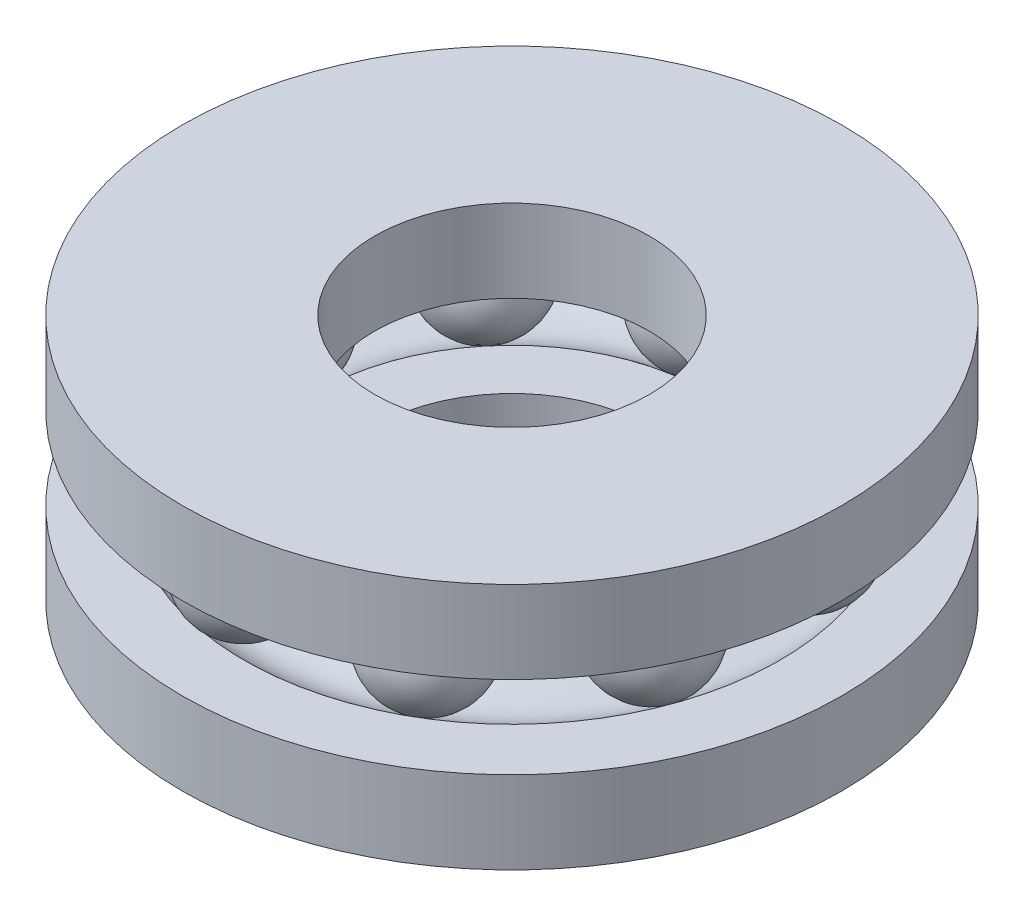
ISO-10303-21;
HEADER;
FILE_DESCRIPTION(('STEP AP214'),'2;1');
FILE_NAME('part.step','',(''),(''),'','','');
FILE_SCHEMA(('AUTOMOTIVE_DESIGN { 1 0 10303 214 1 1 1 1 }'));
ENDSEC;
DATA;
#1=APPLICATION_CONTEXT('core data for automotive mechanical design processes');
#2=APPLICATION_PROTOCOL_DEFINITION('international standard','automotive_design',2000,#1);
#3=PRODUCT_CONTEXT('',#1,'mechanical');
#4=PRODUCT('Part','Part','',(#3));
#5=PRODUCT_RELATED_PRODUCT_CATEGORY('part','',(#4));
#6=PRODUCT_DEFINITION_FORMATION('','',#4);
#7=PRODUCT_DEFINITION_CONTEXT('part definition',#1,'design');
#8=PRODUCT_DEFINITION('design','',#6,#7);
#9=PRODUCT_DEFINITION_SHAPE('','',#8);
#10=(LENGTH_UNIT() NAMED_UNIT(*) SI_UNIT(.MILLI.,.METRE.));
#11=(NAMED_UNIT(*) PLANE_ANGLE_UNIT() SI_UNIT($,.RADIAN.));
#12=(NAMED_UNIT(*) SI_UNIT($,.STERADIAN.) SOLID_ANGLE_UNIT());
#13=UNCERTAINTY_MEASURE_WITH_UNIT(LENGTH_MEASURE(1.E-05),#10,'distance_accuracy_value','');
#14=(GEOMETRIC_REPRESENTATION_CONTEXT(3) GLOBAL_UNCERTAINTY_ASSIGNED_CONTEXT((#13)) GLOBAL_UNIT_ASSIGNED_CONTEXT((#10,
#11,#12)) REPRESENTATION_CONTEXT('',''));
#15=CARTESIAN_POINT('',(0.,0.,0.));
#16=DIRECTION('',(0.,0.,1.));
#17=DIRECTION('',(1.,0.,0.));
#18=AXIS2_PLACEMENT_3D('',#15,#16,#17);
#19=CARTESIAN_POINT('',(-6.47236733113556,4.51804704389821,5.43096104039959));
#20=DIRECTION('',(0.,1.,0.));
#21=DIRECTION('',(0.766044443118986,0.,-0.64278760968653));
#22=AXIS2_PLACEMENT_3D('',#19,#20,#21);
#23=SPHERICAL_SURFACE('',#22,2.);
#24=CARTESIAN_POINT('',(-6.47236733113556,6.51804704389821,5.43096104039959));
#25=VERTEX_POINT('',#24);
#26=VERTEX_LOOP('',#25);
#27=FACE_BOUND('',#26,.T.);
#28=ADVANCED_FACE('F43',(#27),#23,.T.);
#29=CLOSED_SHELL('',(#28));
#30=MANIFOLD_SOLID_BREP('B2',#29);
#31=CARTESIAN_POINT('',(-1.46716656238202,4.51804704389821,8.32071505158765));
#32=DIRECTION('',(0.,1.,0.));
#33=DIRECTION('',(0.17364817766694,0.,-0.984807753012206));
#34=AXIS2_PLACEMENT_3D('',#31,#32,#33);
#35=SPHERICAL_SURFACE('',#34,2.);
#36=CARTESIAN_POINT('',(-1.46716656238202,6.51804704389821,8.32071505158765));
#37=VERTEX_POINT('',#36);
#38=VERTEX_LOOP('',#37);
#39=FACE_BOUND('',#38,.T.);
#40=ADVANCED_FACE('F61',(#39),#35,.T.);
#41=CLOSED_SHELL('',(#40));
#42=MANIFOLD_SOLID_BREP('B6',#41);
#43=CARTESIAN_POINT('',(4.22453774665012,4.51804704389821,7.31711401569071));
#44=DIRECTION('',(0.,1.,0.));
#45=DIRECTION('',(-0.499999999999992,0.,-0.866025403784443));
#46=AXIS2_PLACEMENT_3D('',#43,#44,#45);
#47=SPHERICAL_SURFACE('',#46,2.);
#48=CARTESIAN_POINT('',(4.22453774665012,6.51804704389821,7.31711401569071));
#49=VERTEX_POINT('',#48);
#50=VERTEX_LOOP('',#49);
#51=FACE_BOUND('',#50,.T.);
#52=ADVANCED_FACE('F79',(#51),#47,.T.);
#53=CLOSED_SHELL('',(#52));
#54=MANIFOLD_SOLID_BREP('B39',#53);
#55=CARTESIAN_POINT('',(7.93953389351741,4.51804704389821,2.88975401118805));
#56=DIRECTION('',(0.,1.,0.));
#57=DIRECTION('',(-0.939692620785906,0.,-0.342020143325676));
#58=AXIS2_PLACEMENT_3D('',#55,#56,#57);
#59=SPHERICAL_SURFACE('',#58,2.);
#60=CARTESIAN_POINT('',(7.93953389351741,6.51804704389821,2.88975401118805));
#61=VERTEX_POINT('',#60);
#62=VERTEX_LOOP('',#61);
#63=FACE_BOUND('',#62,.T.);
#64=ADVANCED_FACE('F97',(#63),#59,.T.);
#65=CLOSED_SHELL('',(#64));
#66=MANIFOLD_SOLID_BREP('B57',#65);
#67=CARTESIAN_POINT('',(7.93953389351745,4.51804704389821,-2.88975401118794));
#68=DIRECTION('',(0.,1.,0.));
#69=DIRECTION('',(-0.939692620785911,0.,0.342020143325663));
#70=AXIS2_PLACEMENT_3D('',#67,#68,#69);
#71=SPHERICAL_SURFACE('',#70,2.);
#72=CARTESIAN_POINT('',(7.93953389351745,6.51804704389821,-2.88975401118794));
#73=VERTEX_POINT('',#72);
#74=VERTEX_LOOP('',#73);
#75=FACE_BOUND('',#74,.T.);
#76=ADVANCED_FACE('F115',(#75),#71,.T.);
#77=CLOSED_SHELL('',(#76));
#78=MANIFOLD_SOLID_BREP('B75',#77);
#79=CARTESIAN_POINT('',(4.22453774665023,4.51804704389821,-7.31711401569065));
#80=DIRECTION('',(0.,1.,0.));
#81=DIRECTION('',(-0.500000000000004,0.,0.866025403784436));
#82=AXIS2_PLACEMENT_3D('',#79,#80,#81);
#83=SPHERICAL_SURFACE('',#82,2.);
#84=CARTESIAN_POINT('',(4.22453774665023,6.51804704389821,-7.31711401569065));
#85=VERTEX_POINT('',#84);
#86=VERTEX_LOOP('',#85);
#87=FACE_BOUND('',#86,.T.);
#88=ADVANCED_FACE('F133',(#87),#83,.T.);
#89=CLOSED_SHELL('',(#88));
#90=MANIFOLD_SOLID_BREP('B93',#89);
#91=CARTESIAN_POINT('',(-1.46716656238191,4.51804704389821,-8.32071505158767));
#92=DIRECTION('',(0.,1.,0.));
#93=DIRECTION('',(0.173648177666927,0.,0.984807753012209));
#94=AXIS2_PLACEMENT_3D('',#91,#92,#93);
#95=SPHERICAL_SURFACE('',#94,2.);
#96=CARTESIAN_POINT('',(-1.46716656238191,6.51804704389821,-8.32071505158767));
#97=VERTEX_POINT('',#96);
#98=VERTEX_LOOP('',#97);
#99=FACE_BOUND('',#98,.T.);
#100=ADVANCED_FACE('F151',(#99),#95,.T.);
#101=CLOSED_SHELL('',(#100));
#102=MANIFOLD_SOLID_BREP('B111',#101);
#103=CARTESIAN_POINT('',(-6.47236733113549,4.51804704389821,-5.43096104039968));
#104=DIRECTION('',(0.,1.,0.));
#105=DIRECTION('',(0.766044443118977,0.,0.642787609686541));
#106=AXIS2_PLACEMENT_3D('',#103,#104,#105);
#107=SPHERICAL_SURFACE('',#106,2.);
#108=CARTESIAN_POINT('',(-6.47236733113549,6.51804704389821,-5.43096104039968));
#109=VERTEX_POINT('',#108);
#110=VERTEX_LOOP('',#109);
#111=FACE_BOUND('',#110,.T.);
#112=ADVANCED_FACE('F169',(#111),#107,.T.);
#113=CLOSED_SHELL('',(#112));
#114=MANIFOLD_SOLID_BREP('B129',#113);
#115=CARTESIAN_POINT('',(-8.44907549330038,4.51804704389821,0.));
#116=DIRECTION('',(0.,1.,0.));
#117=DIRECTION('',(1.,0.,0.));
#118=AXIS2_PLACEMENT_3D('',#115,#116,#117);
#119=SPHERICAL_SURFACE('',#118,2.);
#120=CARTESIAN_POINT('',(-8.44907549330038,6.51804704389821,0.));
#121=VERTEX_POINT('',#120);
#122=VERTEX_LOOP('',#121);
#123=FACE_BOUND('',#122,.T.);
#124=ADVANCED_FACE('F189',(#123),#119,.T.);
#125=CLOSED_SHELL('',(#124));
#126=MANIFOLD_SOLID_BREP('B147',#125);
#127=CARTESIAN_POINT('',(0.,4.51804704389821,0.));
#128=DIRECTION('',(0.,-1.,0.));
#129=DIRECTION('',(0.,0.,-1.));
#130=AXIS2_PLACEMENT_3D('',#127,#128,#129);
#131=TOROIDAL_SURFACE('',#130,8.44907549330039,2.);
#132=CARTESIAN_POINT('',(0.,3.,0.));
#133=DIRECTION('',(0.,-1.,0.));
#134=DIRECTION('',(0.,0.,-1.));
#135=AXIS2_PLACEMENT_3D('',#132,#133,#134);
#136=CIRCLE('',#135,7.1469490891015);
#137=CARTESIAN_POINT('',(0.,3.,-7.1469490891015));
#138=VERTEX_POINT('',#137);
#139=EDGE_CURVE('E235',#138,#138,#136,.T.);
#140=ORIENTED_EDGE('',*,*,#139,.T.);
#141=EDGE_LOOP('',(#140));
#142=FACE_BOUND('',#141,.T.);
#143=CARTESIAN_POINT('',(0.,3.,0.));
#144=DIRECTION('',(0.,-1.,0.));
#145=DIRECTION('',(0.,0.,-1.));
#146=AXIS2_PLACEMENT_3D('',#143,#144,#145);
#147=CIRCLE('',#146,9.75120189749927);
#148=CARTESIAN_POINT('',(0.,3.,-9.75120189749927));
#149=VERTEX_POINT('',#148);
#150=EDGE_CURVE('E188',#149,#149,#147,.T.);
#151=ORIENTED_EDGE('',*,*,#150,.F.);
#152=EDGE_LOOP('',(#151));
#153=FACE_BOUND('',#152,.T.);
#154=ADVANCED_FACE('F208',(#142,#153),#131,.F.);
#155=CARTESIAN_POINT('',(0.,3.,0.));
#156=DIRECTION('',(0.,1.,0.));
#157=DIRECTION('',(0.,0.,1.));
#158=AXIS2_PLACEMENT_3D('',#155,#156,#157);
#159=PLANE('',#158);
#160=ORIENTED_EDGE('',*,*,#150,.T.);
#161=EDGE_LOOP('',(#160));
#162=FACE_BOUND('',#161,.T.);
#163=CARTESIAN_POINT('',(0.,3.,0.));
#164=DIRECTION('',(0.,-1.,0.));
#165=DIRECTION('',(0.,0.,-1.));
#166=AXIS2_PLACEMENT_3D('',#163,#164,#165);
#167=CIRCLE('',#166,12.);
#168=CARTESIAN_POINT('',(0.,3.,-12.));
#169=VERTEX_POINT('',#168);
#170=EDGE_CURVE('E215',#169,#169,#167,.T.);
#171=ORIENTED_EDGE('',*,*,#170,.F.);
#172=EDGE_LOOP('',(#171));
#173=FACE_BOUND('',#172,.T.);
#174=ADVANCED_FACE('F247',(#162,#173),#159,.T.);
#175=CARTESIAN_POINT('',(0.,0.,0.));
#176=DIRECTION('',(0.,-1.,0.));
#177=DIRECTION('',(0.,0.,-1.));
#178=AXIS2_PLACEMENT_3D('',#175,#176,#177);
#179=CYLINDRICAL_SURFACE('',#178,12.);
#180=CARTESIAN_POINT('',(0.,0.,0.));
#181=DIRECTION('',(0.,-1.,0.));
#182=DIRECTION('',(0.,0.,-1.));
#183=AXIS2_PLACEMENT_3D('',#180,#181,#182);
#184=CIRCLE('',#183,12.);
#185=CARTESIAN_POINT('',(0.,0.,-12.));
#186=VERTEX_POINT('',#185);
#187=EDGE_CURVE('E221',#186,#186,#184,.T.);
#188=ORIENTED_EDGE('',*,*,#187,.F.);
#189=EDGE_LOOP('',(#188));
#190=FACE_BOUND('',#189,.T.);
#191=ORIENTED_EDGE('',*,*,#170,.T.);
#192=EDGE_LOOP('',(#191));
#193=FACE_BOUND('',#192,.T.);
#194=ADVANCED_FACE('F255',(#190,#193),#179,.T.);
#195=CARTESIAN_POINT('',(0.,0.,0.));
#196=DIRECTION('',(0.,1.,0.));
#197=DIRECTION('',(0.,0.,1.));
#198=AXIS2_PLACEMENT_3D('',#195,#196,#197);
#199=PLANE('',#198);
#200=CARTESIAN_POINT('',(0.,0.,0.));
#201=DIRECTION('',(0.,-1.,0.));
#202=DIRECTION('',(0.,0.,-1.));
#203=AXIS2_PLACEMENT_3D('',#200,#201,#202);
#204=CIRCLE('',#203,5.);
#205=CARTESIAN_POINT('',(0.,0.,-5.));
#206=VERTEX_POINT('',#205);
#207=EDGE_CURVE('E226',#206,#206,#204,.T.);
#208=ORIENTED_EDGE('',*,*,#207,.F.);
#209=EDGE_LOOP('',(#208));
#210=FACE_BOUND('',#209,.T.);
#211=ORIENTED_EDGE('',*,*,#187,.T.);
#212=EDGE_LOOP('',(#211));
#213=FACE_BOUND('',#212,.T.);
#214=ADVANCED_FACE('F251',(#210,#213),#199,.F.);
#215=CARTESIAN_POINT('',(0.,0.,0.));
#216=DIRECTION('',(0.,-1.,0.));
#217=DIRECTION('',(0.,0.,-1.));
#218=AXIS2_PLACEMENT_3D('',#215,#216,#217);
#219=CYLINDRICAL_SURFACE('',#218,5.);
#220=ORIENTED_EDGE('',*,*,#207,.T.);
#221=EDGE_LOOP('',(#220));
#222=FACE_BOUND('',#221,.T.);
#223=CARTESIAN_POINT('',(0.,3.,0.));
#224=DIRECTION('',(0.,-1.,0.));
#225=DIRECTION('',(0.,0.,-1.));
#226=AXIS2_PLACEMENT_3D('',#223,#224,#225);
#227=CIRCLE('',#226,5.);
#228=CARTESIAN_POINT('',(0.,3.,-5.));
#229=VERTEX_POINT('',#228);
#230=EDGE_CURVE('E232',#229,#229,#227,.T.);
#231=ORIENTED_EDGE('',*,*,#230,.F.);
#232=EDGE_LOOP('',(#231));
#233=FACE_BOUND('',#232,.T.);
#234=ADVANCED_FACE('F244',(#222,#233),#219,.F.);
#235=ORIENTED_EDGE('',*,*,#230,.T.);
#236=EDGE_LOOP('',(#235));
#237=FACE_BOUND('',#236,.T.);
#238=ORIENTED_EDGE('',*,*,#139,.F.);
#239=EDGE_LOOP('',(#238));
#240=FACE_BOUND('',#239,.T.);
#241=ADVANCED_FACE('F242',(#237,#240),#159,.T.);
#242=CLOSED_SHELL('',(#154,#174,#194,#214,#234,#241));
#243=MANIFOLD_SOLID_BREP('B165',#242);
#244=CARTESIAN_POINT('',(0.,4.51804704389821,0.));
#245=DIRECTION('',(0.,-1.,0.));
#246=DIRECTION('',(0.,0.,-1.));
#247=AXIS2_PLACEMENT_3D('',#244,#245,#246);
#248=TOROIDAL_SURFACE('',#247,8.44907549330039,2.);
#249=CARTESIAN_POINT('',(0.,6.,0.));
#250=DIRECTION('',(0.,-1.,0.));
#251=DIRECTION('',(0.,0.,-1.));
#252=AXIS2_PLACEMENT_3D('',#249,#250,#251);
#253=CIRCLE('',#252,9.79213745609331);
#254=CARTESIAN_POINT('',(0.,6.,-9.79213745609331));
#255=VERTEX_POINT('',#254);
#256=EDGE_CURVE('E334',#255,#255,#253,.T.);
#257=ORIENTED_EDGE('',*,*,#256,.T.);
#258=EDGE_LOOP('',(#257));
#259=FACE_BOUND('',#258,.T.);
#260=CARTESIAN_POINT('',(0.,6.,0.));
#261=DIRECTION('',(0.,-1.,0.));
#262=DIRECTION('',(0.,0.,-1.));
#263=AXIS2_PLACEMENT_3D('',#260,#261,#262);
#264=CIRCLE('',#263,7.10601353050747);
#265=CARTESIAN_POINT('',(0.,6.,-7.10601353050747));
#266=VERTEX_POINT('',#265);
#267=EDGE_CURVE('E207',#266,#266,#264,.T.);
#268=ORIENTED_EDGE('',*,*,#267,.F.);
#269=EDGE_LOOP('',(#268));
#270=FACE_BOUND('',#269,.T.);
#271=ADVANCED_FACE('F306',(#259,#270),#248,.F.);
#272=CARTESIAN_POINT('',(0.,6.,0.));
#273=DIRECTION('',(0.,1.,0.));
#274=DIRECTION('',(0.,0.,1.));
#275=AXIS2_PLACEMENT_3D('',#272,#273,#274);
#276=PLANE('',#275);
#277=CARTESIAN_POINT('',(0.,6.,0.));
#278=DIRECTION('',(0.,-1.,0.));
#279=DIRECTION('',(0.,0.,-1.));
#280=AXIS2_PLACEMENT_3D('',#277,#278,#279);
#281=CIRCLE('',#280,5.);
#282=CARTESIAN_POINT('',(0.,6.,-5.));
#283=VERTEX_POINT('',#282);
#284=EDGE_CURVE('E313',#283,#283,#281,.T.);
#285=ORIENTED_EDGE('',*,*,#284,.F.);
#286=EDGE_LOOP('',(#285));
#287=FACE_BOUND('',#286,.T.);
#288=ORIENTED_EDGE('',*,*,#267,.T.);
#289=EDGE_LOOP('',(#288));
#290=FACE_BOUND('',#289,.T.);
#291=ADVANCED_FACE('F345',(#287,#290),#276,.F.);
#292=CARTESIAN_POINT('',(0.,0.,0.));
#293=DIRECTION('',(0.,-1.,0.));
#294=DIRECTION('',(0.,0.,-1.));
#295=AXIS2_PLACEMENT_3D('',#292,#293,#294);
#296=CYLINDRICAL_SURFACE('',#295,5.);
#297=CARTESIAN_POINT('',(0.,9.,0.));
#298=DIRECTION('',(0.,-1.,0.));
#299=DIRECTION('',(0.,0.,-1.));
#300=AXIS2_PLACEMENT_3D('',#297,#298,#299);
#301=CIRCLE('',#300,5.);
#302=CARTESIAN_POINT('',(0.,9.,-5.));
#303=VERTEX_POINT('',#302);
#304=EDGE_CURVE('E319',#303,#303,#301,.T.);
#305=ORIENTED_EDGE('',*,*,#304,.F.);
#306=EDGE_LOOP('',(#305));
#307=FACE_BOUND('',#306,.T.);
#308=ORIENTED_EDGE('',*,*,#284,.T.);
#309=EDGE_LOOP('',(#308));
#310=FACE_BOUND('',#309,.T.);
#311=ADVANCED_FACE('F355',(#307,#310),#296,.F.);
#312=CARTESIAN_POINT('',(0.,9.,0.));
#313=DIRECTION('',(0.,1.,0.));
#314=DIRECTION('',(0.,0.,1.));
#315=AXIS2_PLACEMENT_3D('',#312,#313,#314);
#316=PLANE('',#315);
#317=ORIENTED_EDGE('',*,*,#304,.T.);
#318=EDGE_LOOP('',(#317));
#319=FACE_BOUND('',#318,.T.);
#320=CARTESIAN_POINT('',(0.,9.,0.));
#321=DIRECTION('',(0.,-1.,0.));
#322=DIRECTION('',(0.,0.,-1.));
#323=AXIS2_PLACEMENT_3D('',#320,#321,#322);
#324=CIRCLE('',#323,12.);
#325=CARTESIAN_POINT('',(0.,9.,-12.));
#326=VERTEX_POINT('',#325);
#327=EDGE_CURVE('E324',#326,#326,#324,.T.);
#328=ORIENTED_EDGE('',*,*,#327,.F.);
#329=EDGE_LOOP('',(#328));
#330=FACE_BOUND('',#329,.T.);
#331=ADVANCED_FACE('F349',(#319,#330),#316,.T.);
#332=CARTESIAN_POINT('',(0.,0.,0.));
#333=DIRECTION('',(0.,-1.,0.));
#334=DIRECTION('',(0.,0.,-1.));
#335=AXIS2_PLACEMENT_3D('',#332,#333,#334);
#336=CYLINDRICAL_SURFACE('',#335,12.);
#337=ORIENTED_EDGE('',*,*,#327,.T.);
#338=EDGE_LOOP('',(#337));
#339=FACE_BOUND('',#338,.T.);
#340=CARTESIAN_POINT('',(0.,6.,0.));
#341=DIRECTION('',(0.,-1.,0.));
#342=DIRECTION('',(0.,0.,-1.));
#343=AXIS2_PLACEMENT_3D('',#340,#341,#342);
#344=CIRCLE('',#343,12.);
#345=CARTESIAN_POINT('',(0.,6.,-12.));
#346=VERTEX_POINT('',#345);
#347=EDGE_CURVE('E330',#346,#346,#344,.T.);
#348=ORIENTED_EDGE('',*,*,#347,.F.);
#349=EDGE_LOOP('',(#348));
#350=FACE_BOUND('',#349,.T.);
#351=ADVANCED_FACE('F343',(#339,#350),#336,.T.);
#352=ORIENTED_EDGE('',*,*,#256,.F.);
#353=EDGE_LOOP('',(#352));
#354=FACE_BOUND('',#353,.T.);
#355=ORIENTED_EDGE('',*,*,#347,.T.);
#356=EDGE_LOOP('',(#355));
#357=FACE_BOUND('',#356,.T.);
#358=ADVANCED_FACE('F340',(#354,#357),#276,.F.);
#359=CLOSED_SHELL('',(#271,#291,#311,#331,#351,#358));
#360=MANIFOLD_SOLID_BREP('B183',#359);
#361=ADVANCED_BREP_SHAPE_REPRESENTATION('',(#18,#30,#42,#54,#66,#78,#90,#102,#114,#126,#243,
#360),#14);
#362=SHAPE_DEFINITION_REPRESENTATION(#9,#361);
ENDSEC;
END-ISO-10303-21;
